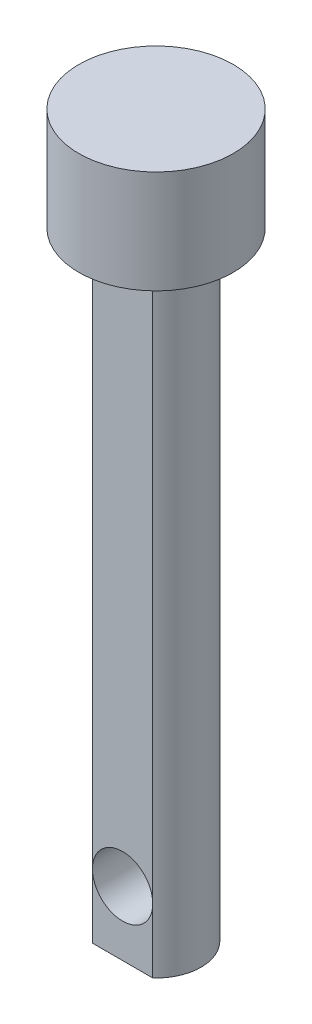
ISO-10303-21;
HEADER;
FILE_DESCRIPTION(('STEP AP214'),'2;1');
FILE_NAME('part.step','',(''),(''),'','','');
FILE_SCHEMA(('AUTOMOTIVE_DESIGN { 1 0 10303 214 1 1 1 1 }'));
ENDSEC;
DATA;
#1=APPLICATION_CONTEXT('core data for automotive mechanical design processes');
#2=APPLICATION_PROTOCOL_DEFINITION('international standard','automotive_design',2000,#1);
#3=PRODUCT_CONTEXT('',#1,'mechanical');
#4=PRODUCT('Part','Part','',(#3));
#5=PRODUCT_RELATED_PRODUCT_CATEGORY('part','',(#4));
#6=PRODUCT_DEFINITION_FORMATION('','',#4);
#7=PRODUCT_DEFINITION_CONTEXT('part definition',#1,'design');
#8=PRODUCT_DEFINITION('design','',#6,#7);
#9=PRODUCT_DEFINITION_SHAPE('','',#8);
#10=(LENGTH_UNIT() NAMED_UNIT(*) SI_UNIT(.MILLI.,.METRE.));
#11=(NAMED_UNIT(*) PLANE_ANGLE_UNIT() SI_UNIT($,.RADIAN.));
#12=(NAMED_UNIT(*) SI_UNIT($,.STERADIAN.) SOLID_ANGLE_UNIT());
#13=UNCERTAINTY_MEASURE_WITH_UNIT(LENGTH_MEASURE(1.E-05),#10,'distance_accuracy_value','');
#14=(GEOMETRIC_REPRESENTATION_CONTEXT(3) GLOBAL_UNCERTAINTY_ASSIGNED_CONTEXT((#13)) GLOBAL_UNIT_ASSIGNED_CONTEXT((#10,
#11,#12)) REPRESENTATION_CONTEXT('',''));
#15=CARTESIAN_POINT('',(0.,0.,0.));
#16=DIRECTION('',(0.,0.,1.));
#17=DIRECTION('',(1.,0.,0.));
#18=AXIS2_PLACEMENT_3D('',#15,#16,#17);
#19=CARTESIAN_POINT('',(-1.171537451386,26.385896058088,1.3));
#20=DIRECTION('',(0.,0.,-1.));
#21=DIRECTION('',(-1.,0.,0.));
#22=AXIS2_PLACEMENT_3D('',#19,#20,#21);
#23=PLANE('',#22);
#24=DIRECTION('',(0.,-1.,0.));
#25=VECTOR('',#24,1.);
#26=CARTESIAN_POINT('',(-1.171537451386,26.385896058088,1.3));
#27=LINE('',#26,#25);
#28=CARTESIAN_POINT('',(-1.171537451386,24.,1.3));
#29=VERTEX_POINT('',#28);
#30=CARTESIAN_POINT('',(-1.171537451386,2.5,1.3));
#31=VERTEX_POINT('',#30);
#32=EDGE_CURVE('E82',#29,#31,#27,.T.);
#33=ORIENTED_EDGE('',*,*,#32,.T.);
#34=CARTESIAN_POINT('',(0.,2.5,1.3));
#35=DIRECTION('',(0.,0.,1.));
#36=DIRECTION('',(1.,0.,0.));
#37=AXIS2_PLACEMENT_3D('',#34,#35,#36);
#38=CIRCLE('',#37,1.171537451386);
#39=CARTESIAN_POINT('',(1.171537451386,2.5,1.3));
#40=VERTEX_POINT('',#39);
#41=EDGE_CURVE('E57',#40,#31,#38,.T.);
#42=ORIENTED_EDGE('',*,*,#41,.F.);
#43=DIRECTION('',(0.,-1.,0.));
#44=VECTOR('',#43,1.);
#45=CARTESIAN_POINT('',(1.171537451386,26.385896058088,1.3));
#46=LINE('',#45,#44);
#47=CARTESIAN_POINT('',(1.171537451386,24.,1.3));
#48=VERTEX_POINT('',#47);
#49=EDGE_CURVE('E81',#48,#40,#46,.T.);
#50=ORIENTED_EDGE('',*,*,#49,.F.);
#51=DIRECTION('',(1.,0.,0.));
#52=VECTOR('',#51,1.);
#53=CARTESIAN_POINT('',(-1.171537451386,24.,1.3));
#54=LINE('',#53,#52);
#55=EDGE_CURVE('E64',#29,#48,#54,.T.);
#56=ORIENTED_EDGE('',*,*,#55,.F.);
#57=EDGE_LOOP('',(#33,#42,#50,#56));
#58=FACE_BOUND('',#57,.T.);
#59=ADVANCED_FACE('F42',(#58),#23,.F.);
#60=CARTESIAN_POINT('',(0.,0.,1.75));
#61=DIRECTION('',(0.,1.,0.));
#62=DIRECTION('',(0.,0.,1.));
#63=AXIS2_PLACEMENT_3D('',#60,#61,#62);
#64=PLANE('',#63);
#65=CARTESIAN_POINT('',(0.,0.,0.));
#66=DIRECTION('',(0.,-1.,0.));
#67=DIRECTION('',(0.,0.,-1.));
#68=AXIS2_PLACEMENT_3D('',#65,#66,#67);
#69=CIRCLE('',#68,1.75);
#70=CARTESIAN_POINT('',(-1.171537451386,0.,1.3));
#71=VERTEX_POINT('',#70);
#72=CARTESIAN_POINT('',(1.171537451386,0.,1.3));
#73=VERTEX_POINT('',#72);
#74=EDGE_CURVE('E108',#71,#73,#69,.T.);
#75=ORIENTED_EDGE('',*,*,#74,.T.);
#76=DIRECTION('',(1.,0.,0.));
#77=VECTOR('',#76,1.);
#78=CARTESIAN_POINT('',(-1.171537451386,0.,1.3));
#79=LINE('',#78,#77);
#80=EDGE_CURVE('E90',#71,#73,#79,.T.);
#81=ORIENTED_EDGE('',*,*,#80,.F.);
#82=EDGE_LOOP('',(#75,#81));
#83=FACE_BOUND('',#82,.T.);
#84=ADVANCED_FACE('F44',(#83),#64,.F.);
#85=CARTESIAN_POINT('',(0.,28.,0.));
#86=DIRECTION('',(0.,-1.,0.));
#87=DIRECTION('',(0.,0.,-1.));
#88=AXIS2_PLACEMENT_3D('',#85,#86,#87);
#89=PLANE('',#88);
#90=CARTESIAN_POINT('',(0.,28.,0.));
#91=DIRECTION('',(0.,-1.,0.));
#92=DIRECTION('',(0.,0.,-1.));
#93=AXIS2_PLACEMENT_3D('',#90,#91,#92);
#94=CIRCLE('',#93,3.);
#95=CARTESIAN_POINT('',(0.,28.,-3.));
#96=VERTEX_POINT('',#95);
#97=EDGE_CURVE('E51',#96,#96,#94,.T.);
#98=ORIENTED_EDGE('',*,*,#97,.F.);
#99=EDGE_LOOP('',(#98));
#100=FACE_BOUND('',#99,.T.);
#101=ADVANCED_FACE('F122',(#100),#89,.F.);
#102=CARTESIAN_POINT('',(0.,0.,0.));
#103=DIRECTION('',(0.,-1.,0.));
#104=DIRECTION('',(0.,0.,-1.));
#105=AXIS2_PLACEMENT_3D('',#102,#103,#104);
#106=CYLINDRICAL_SURFACE('',#105,3.);
#107=CARTESIAN_POINT('',(0.,24.,0.));
#108=DIRECTION('',(0.,-1.,0.));
#109=DIRECTION('',(0.,0.,-1.));
#110=AXIS2_PLACEMENT_3D('',#107,#108,#109);
#111=CIRCLE('',#110,3.);
#112=CARTESIAN_POINT('',(0.,24.,-3.));
#113=VERTEX_POINT('',#112);
#114=EDGE_CURVE('E113',#113,#113,#111,.T.);
#115=ORIENTED_EDGE('',*,*,#114,.F.);
#116=EDGE_LOOP('',(#115));
#117=FACE_BOUND('',#116,.T.);
#118=ORIENTED_EDGE('',*,*,#97,.T.);
#119=EDGE_LOOP('',(#118));
#120=FACE_BOUND('',#119,.T.);
#121=ADVANCED_FACE('F120',(#117,#120),#106,.T.);
#122=CARTESIAN_POINT('',(0.,24.,3.));
#123=DIRECTION('',(0.,1.,0.));
#124=DIRECTION('',(0.,0.,1.));
#125=AXIS2_PLACEMENT_3D('',#122,#123,#124);
#126=PLANE('',#125);
#127=CARTESIAN_POINT('',(0.,24.,0.));
#128=DIRECTION('',(0.,-1.,0.));
#129=DIRECTION('',(0.,0.,-1.));
#130=AXIS2_PLACEMENT_3D('',#127,#128,#129);
#131=CIRCLE('',#130,1.75);
#132=EDGE_CURVE('E99',#29,#48,#131,.T.);
#133=ORIENTED_EDGE('',*,*,#132,.F.);
#134=ORIENTED_EDGE('',*,*,#55,.T.);
#135=EDGE_LOOP('',(#133,#134));
#136=FACE_BOUND('',#135,.T.);
#137=ORIENTED_EDGE('',*,*,#114,.T.);
#138=EDGE_LOOP('',(#137));
#139=FACE_BOUND('',#138,.T.);
#140=ADVANCED_FACE('F128',(#136,#139),#126,.F.);
#141=CARTESIAN_POINT('',(0.,0.,0.));
#142=DIRECTION('',(0.,-1.,0.));
#143=DIRECTION('',(0.,0.,-1.));
#144=AXIS2_PLACEMENT_3D('',#141,#142,#143);
#145=CYLINDRICAL_SURFACE('',#144,1.75);
#146=CARTESIAN_POINT('',(1.171537451386,2.5,-1.3));
#147=CARTESIAN_POINT('',(1.17153206239643,2.55708993696069,-1.30000938766297));
#148=CARTESIAN_POINT('',(1.16732558330472,2.61422288692357,-1.30383384878543));
#149=CARTESIAN_POINT('',(1.15085239371755,2.72643960898315,-1.31838864774003));
#150=CARTESIAN_POINT('',(1.13856907554521,2.78151891123059,-1.32913321382499));
#151=CARTESIAN_POINT('',(1.1069189777274,2.88764745090178,-1.35559834440233));
#152=CARTESIAN_POINT('',(1.0876225760015,2.93873080458885,-1.37126926777425));
#153=CARTESIAN_POINT('',(1.04269339912163,3.03684791976482,-1.40573520573303));
#154=CARTESIAN_POINT('',(1.01705948602197,3.08388095194221,-1.42453078117486));
#155=CARTESIAN_POINT('',(0.955499869838515,3.18066622725568,-1.46666940317339));
#156=CARTESIAN_POINT('',(0.91858971867693,3.22968344210809,-1.49026281461528));
#157=CARTESIAN_POINT('',(0.837521703715174,3.32146860611659,-1.53728944557159));
#158=CARTESIAN_POINT('',(0.793356729166382,3.36423034549932,-1.56072248418818));
#159=CARTESIAN_POINT('',(0.691247197527513,3.44851110213248,-1.60882152141119));
#160=CARTESIAN_POINT('',(0.632232097321949,3.48893490463244,-1.63316710666416));
#161=CARTESIAN_POINT('',(0.506293829332456,3.55893197402325,-1.67647921125456));
#162=CARTESIAN_POINT('',(0.439379655407952,3.58851742683559,-1.69545176618793));
#163=CARTESIAN_POINT('',(0.307492806800648,3.63234970739001,-1.72394093234334));
#164=CARTESIAN_POINT('',(0.243153719468258,3.64795107020972,-1.73428323544968));
#165=CARTESIAN_POINT('',(0.112046747649846,3.66804389226368,-1.74764621185779));
#166=CARTESIAN_POINT('',(0.0452820725359452,3.67254952569138,-1.75067622611329));
#167=CARTESIAN_POINT('',(-0.0776750577366575,3.67032292141078,-1.74918805051051));
#168=CARTESIAN_POINT('',(-0.133919289923236,3.66520747830772,-1.74575573546734));
#169=CARTESIAN_POINT('',(-0.244547604549842,3.64709933733847,-1.73372164047444));
#170=CARTESIAN_POINT('',(-0.298931551020264,3.63410606497028,-1.72511948350698));
#171=CARTESIAN_POINT('',(-0.40424068734974,3.60096637861611,-1.70351709951275));
#172=CARTESIAN_POINT('',(-0.455180137755839,3.58085192155305,-1.69053653307186));
#173=CARTESIAN_POINT('',(-0.552954855553768,3.53425181973097,-1.66112929702935));
#174=CARTESIAN_POINT('',(-0.599789382452183,3.50776502867089,-1.64470200747458));
#175=CARTESIAN_POINT('',(-0.694658842723006,3.4452975627046,-1.60713490729103));
#176=CARTESIAN_POINT('',(-0.742038330292236,3.40852568302784,-1.58565934584007));
#177=CARTESIAN_POINT('',(-0.830363370730681,3.32858482222512,-1.54124853728401));
#178=CARTESIAN_POINT('',(-0.871298776653365,3.28540595616249,-1.5183110664525));
#179=CARTESIAN_POINT('',(-0.952159624317598,3.1860177743355,-1.4691703311668));
#180=CARTESIAN_POINT('',(-0.99091896727948,3.12882693788623,-1.44301930203156));
#181=CARTESIAN_POINT('',(-1.05826166475186,3.00733272954091,-1.39438421747018));
#182=CARTESIAN_POINT('',(-1.08686194374685,2.94304142319892,-1.37189409734896));
#183=CARTESIAN_POINT('',(-1.12592097645164,2.82767751643734,-1.33986903379493));
#184=CARTESIAN_POINT('',(-1.13922958147727,2.77809331182504,-1.32846847669697));
#185=CARTESIAN_POINT('',(-1.15927719584606,2.67673261596834,-1.31101377931238));
#186=CARTESIAN_POINT('',(-1.16602757454832,2.62496008165037,-1.30495038822191));
#187=CARTESIAN_POINT('',(-1.17253602887026,2.52036819595507,-1.29910804091731));
#188=CARTESIAN_POINT('',(-1.17226221171185,2.46754515844111,-1.29935774873046));
#189=CARTESIAN_POINT('',(-1.16466334947025,2.36281131330667,-1.30617078058358));
#190=CARTESIAN_POINT('',(-1.15733346187595,2.31090115710202,-1.31273844056929));
#191=CARTESIAN_POINT('',(-1.13667135986742,2.21207848299321,-1.33065767268478));
#192=CARTESIAN_POINT('',(-1.12366770224728,2.16504626523561,-1.34174545727825));
#193=CARTESIAN_POINT('',(-1.09232801476266,2.07379475817527,-1.36738041443424));
#194=CARTESIAN_POINT('',(-1.07398786755026,2.02957767310449,-1.38193025654818));
#195=CARTESIAN_POINT('',(-1.02275979071207,1.92441041866968,-1.42053149897899));
#196=CARTESIAN_POINT('',(-0.987076713404862,1.8652785002508,-1.44584873880313));
#197=CARTESIAN_POINT('',(-0.906280284170156,1.75443192600193,-1.4978223199435));
#198=CARTESIAN_POINT('',(-0.861150181889371,1.70273072382031,-1.52448097505134));
#199=CARTESIAN_POINT('',(-0.761733932975505,1.60722567295448,-1.57652650118382));
#200=CARTESIAN_POINT('',(-0.707379187399849,1.56348649448775,-1.60190184485148));
#201=CARTESIAN_POINT('',(-0.590574681242377,1.48579163189172,-1.64853132957809));
#202=CARTESIAN_POINT('',(-0.528141539776408,1.45181631112885,-1.6697937138646));
#203=CARTESIAN_POINT('',(-0.410888115107656,1.40145023863542,-1.70191804566255));
#204=CARTESIAN_POINT('',(-0.357363047362034,1.38284244273071,-1.71403609887244));
#205=CARTESIAN_POINT('',(-0.247346437104345,1.35346004030514,-1.73332904725088));
#206=CARTESIAN_POINT('',(-0.190856902921425,1.3426802022181,-1.74050724364717));
#207=CARTESIAN_POINT('',(-0.0762837772659036,1.32952343980843,-1.74928299103347));
#208=CARTESIAN_POINT('',(-0.0181956972806676,1.32717328167271,-1.75086276554671));
#209=CARTESIAN_POINT('',(0.0975582069853436,1.33109624876861,-1.74823734620894));
#210=CARTESIAN_POINT('',(0.155224000470656,1.33736999672963,-1.74403173459711));
#211=CARTESIAN_POINT('',(0.265522269008613,1.35763967732276,-1.73058768629292));
#212=CARTESIAN_POINT('',(0.318262297286664,1.37123440933026,-1.72161101758917));
#213=CARTESIAN_POINT('',(0.420565864560993,1.40522495730642,-1.69951934361264));
#214=CARTESIAN_POINT('',(0.470128838663914,1.42562197877332,-1.68640360483815));
#215=CARTESIAN_POINT('',(0.569161088455513,1.47440285088447,-1.65573542954461));
#216=CARTESIAN_POINT('',(0.618287332357535,1.50330564709467,-1.63790679555946));
#217=CARTESIAN_POINT('',(0.711225603773183,1.56734333253189,-1.59974595914864));
#218=CARTESIAN_POINT('',(0.755033329512227,1.60248321068338,-1.579411756577));
#219=CARTESIAN_POINT('',(0.843648642220815,1.68453673149319,-1.53415083371756));
#220=CARTESIAN_POINT('',(0.88743968685204,1.73243619036893,-1.50901820183841));
#221=CARTESIAN_POINT('',(0.966729552076852,1.8350637454491,-1.45949260880524));
#222=CARTESIAN_POINT('',(1.00222512398062,1.88979450411199,-1.43509994068066));
#223=CARTESIAN_POINT('',(1.05949577310266,1.99692103137244,-1.39321030488312));
#224=CARTESIAN_POINT('',(1.08252652100966,2.04845249870619,-1.37522734395672));
#225=CARTESIAN_POINT('',(1.12117772430326,2.15550247516424,-1.34390626251545));
#226=CARTESIAN_POINT('',(1.13681735683462,2.21101023105991,-1.3305561457332));
#227=CARTESIAN_POINT('',(1.15596391152006,2.30573836365848,-1.31390615728188));
#228=CARTESIAN_POINT('',(1.16178128560528,2.34417097642733,-1.308736901952));
#229=CARTESIAN_POINT('',(1.16956965325716,2.42172904557109,-1.30178082454421));
#230=CARTESIAN_POINT('',(1.17154114652354,2.46085441126912,-1.29999356304082));
#231=CARTESIAN_POINT('',(1.171537451386,2.5,-1.3));
#232=B_SPLINE_CURVE_WITH_KNOTS('',3,(#146,#147,#148,#149,#150,#151,#152,#153,#154,#155,#156,
#157,#158,#159,#160,#161,#162,#163,#164,#165,#166,#167,#168,#169,#170,#171,#172,#173,#174,#175,
#176,#177,#178,#179,#180,#181,#182,#183,#184,#185,#186,#187,#188,#189,#190,#191,#192,#193,#194,
#195,#196,#197,#198,#199,#200,#201,#202,#203,#204,#205,#206,#207,#208,#209,#210,#211,#212,#213,
#214,#215,#216,#217,#218,#219,#220,#221,#222,#223,#224,#225,#226,#227,#228,#229,#230,#231),
.UNSPECIFIED.,.T.,.F.,(4,2,2,2,2,2,2,2,2,2,2,2,2,2,2,2,2,2,2,2,2,2,2,2,2,2,2,2,2,2,2,2,2,2,2,2,
2,2,2,2,2,2,4),(0.,0.171087962931624,0.342528823367266,0.512294706066697,0.682091093616955,
0.878582504889364,1.0752676673152,1.30070133952723,1.52588076546921,1.72563970671646,
1.92514333405561,2.09406476859726,2.26299852345908,2.43118358768954,2.59939892890457,
2.78978634355855,2.98047060943216,3.201071909097,3.42130395525163,3.57845462793245,
3.73533237504711,3.89292253809285,4.05062093086468,4.20019794349244,4.34989066909072,
4.56942489805172,4.78935172734923,5.0109920998188,5.23218354865818,5.40529377189388,
5.57828819568386,5.75183143298133,5.92538720243672,6.09027750986514,6.25519705461103,
6.43368180133495,6.61230996337284,6.82026341708335,7.02829817398582,7.20537840311917,
7.38199661878227,7.49932394045017,7.61663601662808),.UNSPECIFIED.);
#233=CARTESIAN_POINT('',(1.171537451386,2.5,-1.3));
#234=VERTEX_POINT('',#233);
#235=EDGE_CURVE('E84',#234,#234,#232,.T.);
#236=ORIENTED_EDGE('',*,*,#235,.T.);
#237=EDGE_LOOP('',(#236));
#238=FACE_BOUND('',#237,.T.);
#239=ORIENTED_EDGE('',*,*,#132,.T.);
#240=ORIENTED_EDGE('',*,*,#49,.T.);
#241=EDGE_CURVE('E87',#40,#73,#46,.T.);
#242=ORIENTED_EDGE('',*,*,#241,.T.);
#243=ORIENTED_EDGE('',*,*,#74,.F.);
#244=EDGE_CURVE('E101',#31,#71,#27,.T.);
#245=ORIENTED_EDGE('',*,*,#244,.F.);
#246=ORIENTED_EDGE('',*,*,#32,.F.);
#247=EDGE_LOOP('',(#239,#240,#242,#243,#245,#246));
#248=FACE_BOUND('',#247,.T.);
#249=ADVANCED_FACE('F97',(#238,#248),#145,.T.);
#250=ORIENTED_EDGE('',*,*,#241,.F.);
#251=CARTESIAN_POINT('',(0.,2.5,1.3));
#252=DIRECTION('',(0.,0.,-1.));
#253=DIRECTION('',(-1.,0.,0.));
#254=AXIS2_PLACEMENT_3D('',#251,#252,#253);
#255=CIRCLE('',#254,1.171537451386);
#256=EDGE_CURVE('E11',#40,#31,#255,.T.);
#257=ORIENTED_EDGE('',*,*,#256,.T.);
#258=ORIENTED_EDGE('',*,*,#244,.T.);
#259=ORIENTED_EDGE('',*,*,#80,.T.);
#260=EDGE_LOOP('',(#250,#257,#258,#259));
#261=FACE_BOUND('',#260,.T.);
#262=ADVANCED_FACE('F88',(#261),#23,.F.);
#263=CARTESIAN_POINT('',(0.,2.5,-3.));
#264=DIRECTION('',(0.,0.,1.));
#265=DIRECTION('',(1.,0.,0.));
#266=AXIS2_PLACEMENT_3D('',#263,#264,#265);
#267=CYLINDRICAL_SURFACE('',#266,1.171537451386);
#268=ORIENTED_EDGE('',*,*,#41,.T.);
#269=ORIENTED_EDGE('',*,*,#256,.F.);
#270=EDGE_LOOP('',(#268,#269));
#271=FACE_BOUND('',#270,.T.);
#272=ORIENTED_EDGE('',*,*,#235,.F.);
#273=EDGE_LOOP('',(#272));
#274=FACE_BOUND('',#273,.T.);
#275=ADVANCED_FACE('F75',(#271,#274),#267,.F.);
#276=CLOSED_SHELL('',(#59,#84,#101,#121,#140,#249,#262,#275));
#277=MANIFOLD_SOLID_BREP('B2',#276);
#278=ADVANCED_BREP_SHAPE_REPRESENTATION('',(#18,#277),#14);
#279=SHAPE_DEFINITION_REPRESENTATION(#9,#278);
ENDSEC;
END-ISO-10303-21;
